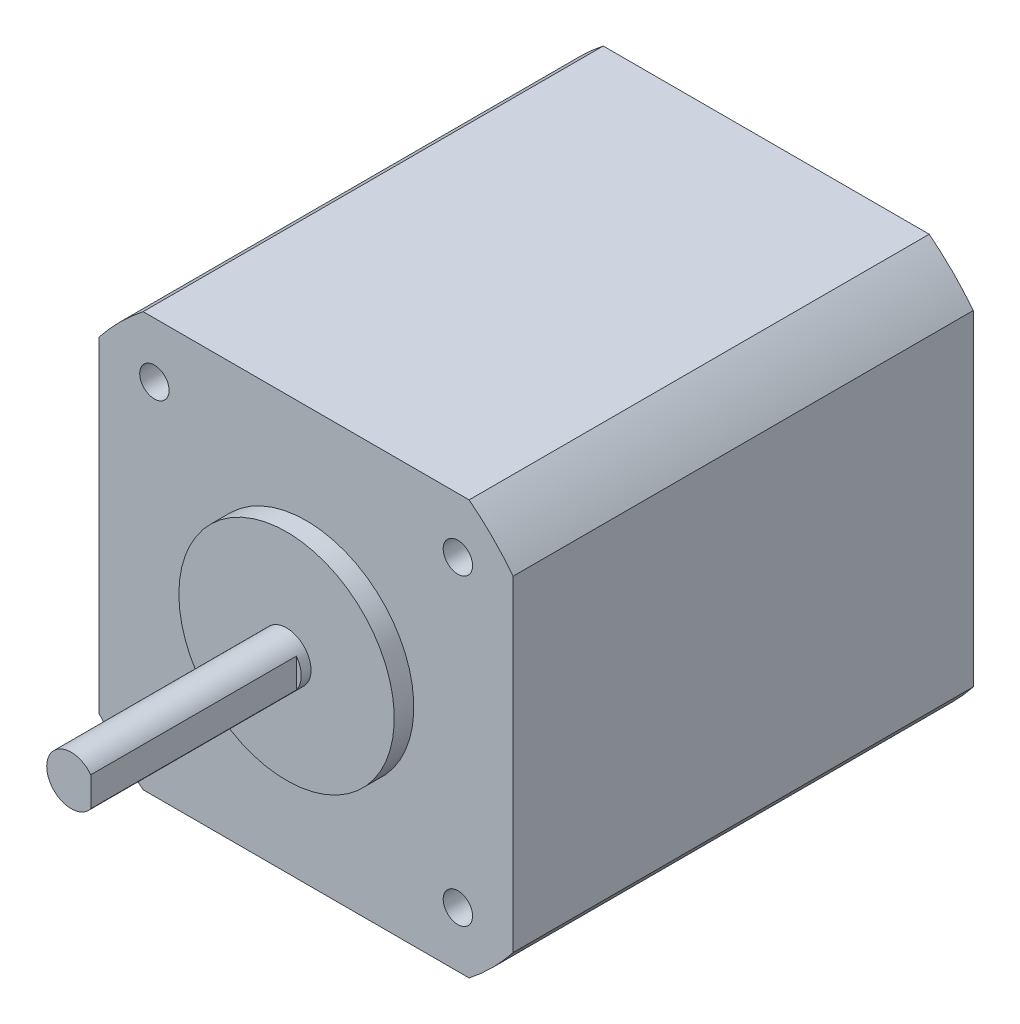
ISO-10303-21;
HEADER;
FILE_DESCRIPTION(('STEP AP214'),'2;1');
FILE_NAME('part.step','',(''),(''),'','','');
FILE_SCHEMA(('AUTOMOTIVE_DESIGN { 1 0 10303 214 1 1 1 1 }'));
ENDSEC;
DATA;
#1=APPLICATION_CONTEXT('core data for automotive mechanical design processes');
#2=APPLICATION_PROTOCOL_DEFINITION('international standard','automotive_design',2000,#1);
#3=PRODUCT_CONTEXT('',#1,'mechanical');
#4=PRODUCT('Part','Part','',(#3));
#5=PRODUCT_RELATED_PRODUCT_CATEGORY('part','',(#4));
#6=PRODUCT_DEFINITION_FORMATION('','',#4);
#7=PRODUCT_DEFINITION_CONTEXT('part definition',#1,'design');
#8=PRODUCT_DEFINITION('design','',#6,#7);
#9=PRODUCT_DEFINITION_SHAPE('','',#8);
#10=(LENGTH_UNIT() NAMED_UNIT(*) SI_UNIT(.MILLI.,.METRE.));
#11=(NAMED_UNIT(*) PLANE_ANGLE_UNIT() SI_UNIT($,.RADIAN.));
#12=(NAMED_UNIT(*) SI_UNIT($,.STERADIAN.) SOLID_ANGLE_UNIT());
#13=UNCERTAINTY_MEASURE_WITH_UNIT(LENGTH_MEASURE(1.E-05),#10,'distance_accuracy_value','');
#14=(GEOMETRIC_REPRESENTATION_CONTEXT(3) GLOBAL_UNCERTAINTY_ASSIGNED_CONTEXT((#13)) GLOBAL_UNIT_ASSIGNED_CONTEXT((#10,
#11,#12)) REPRESENTATION_CONTEXT('',''));
#15=CARTESIAN_POINT('',(0.,0.,0.));
#16=DIRECTION('',(0.,0.,1.));
#17=DIRECTION('',(1.,0.,0.));
#18=AXIS2_PLACEMENT_3D('',#15,#16,#17);
#19=CARTESIAN_POINT('',(2.,-2.,50.));
#20=DIRECTION('',(0.,0.,-1.));
#21=DIRECTION('',(-1.,0.,0.));
#22=AXIS2_PLACEMENT_3D('',#19,#20,#21);
#23=PLANE('',#22);
#24=CARTESIAN_POINT('',(0.,0.,50.));
#25=DIRECTION('',(0.,0.,-1.));
#26=DIRECTION('',(-1.,0.,0.));
#27=AXIS2_PLACEMENT_3D('',#24,#25,#26);
#28=CIRCLE('',#27,2.5);
#29=CARTESIAN_POINT('',(2.,1.5,50.));
#30=VERTEX_POINT('',#29);
#31=CARTESIAN_POINT('',(2.,-1.5,50.));
#32=VERTEX_POINT('',#31);
#33=EDGE_CURVE('E19',#30,#32,#28,.T.);
#34=ORIENTED_EDGE('',*,*,#33,.F.);
#35=DIRECTION('',(0.,1.,0.));
#36=VECTOR('',#35,1.);
#37=CARTESIAN_POINT('',(2.,2.,50.));
#38=LINE('',#37,#36);
#39=EDGE_CURVE('E95',#30,#32,#38,.F.);
#40=ORIENTED_EDGE('',*,*,#39,.T.);
#41=EDGE_LOOP('',(#34,#40));
#42=FACE_BOUND('',#41,.T.);
#43=ADVANCED_FACE('F16',(#42),#23,.F.);
#44=CARTESIAN_POINT('',(2.,2.,72.));
#45=DIRECTION('',(-1.,0.,0.));
#46=DIRECTION('',(0.,0.,1.));
#47=AXIS2_PLACEMENT_3D('',#44,#45,#46);
#48=PLANE('',#47);
#49=DIRECTION('',(0.,0.,-1.));
#50=VECTOR('',#49,1.);
#51=CARTESIAN_POINT('',(2.,1.5,49.));
#52=LINE('',#51,#50);
#53=CARTESIAN_POINT('',(2.,1.5,71.));
#54=VERTEX_POINT('',#53);
#55=EDGE_CURVE('E99',#54,#30,#52,.T.);
#56=ORIENTED_EDGE('',*,*,#55,.F.);
#57=DIRECTION('',(0.,1.,0.));
#58=VECTOR('',#57,1.);
#59=CARTESIAN_POINT('',(2.,0.,71.));
#60=LINE('',#59,#58);
#61=CARTESIAN_POINT('',(2.,-1.5,71.));
#62=VERTEX_POINT('',#61);
#63=EDGE_CURVE('E102',#54,#62,#60,.F.);
#64=ORIENTED_EDGE('',*,*,#63,.T.);
#65=DIRECTION('',(0.,0.,-1.));
#66=VECTOR('',#65,1.);
#67=CARTESIAN_POINT('',(2.,-1.5,49.));
#68=LINE('',#67,#66);
#69=EDGE_CURVE('E101',#32,#62,#68,.F.);
#70=ORIENTED_EDGE('',*,*,#69,.F.);
#71=ORIENTED_EDGE('',*,*,#39,.F.);
#72=EDGE_LOOP('',(#56,#64,#70,#71));
#73=FACE_BOUND('',#72,.T.);
#74=ADVANCED_FACE('F98',(#73),#48,.F.);
#75=CARTESIAN_POINT('',(2.5,0.,71.));
#76=DIRECTION('',(0.,0.,-1.));
#77=DIRECTION('',(-1.,0.,0.));
#78=AXIS2_PLACEMENT_3D('',#75,#76,#77);
#79=PLANE('',#78);
#80=ORIENTED_EDGE('',*,*,#63,.F.);
#81=CARTESIAN_POINT('',(0.,0.,71.));
#82=DIRECTION('',(0.,0.,-1.));
#83=DIRECTION('',(-1.,0.,0.));
#84=AXIS2_PLACEMENT_3D('',#81,#82,#83);
#85=CIRCLE('',#84,2.5);
#86=EDGE_CURVE('E107',#62,#54,#85,.T.);
#87=ORIENTED_EDGE('',*,*,#86,.F.);
#88=EDGE_LOOP('',(#80,#87));
#89=FACE_BOUND('',#88,.T.);
#90=ADVANCED_FACE('F228',(#89),#79,.F.);
#91=CARTESIAN_POINT('',(0.,0.,49.));
#92=DIRECTION('',(0.,0.,-1.));
#93=DIRECTION('',(-1.,0.,0.));
#94=AXIS2_PLACEMENT_3D('',#91,#92,#93);
#95=CYLINDRICAL_SURFACE('',#94,2.5);
#96=CARTESIAN_POINT('',(0.,0.,49.));
#97=DIRECTION('',(0.,0.,-1.));
#98=DIRECTION('',(-1.,0.,0.));
#99=AXIS2_PLACEMENT_3D('',#96,#97,#98);
#100=CIRCLE('',#99,2.5);
#101=CARTESIAN_POINT('',(-2.5,0.,49.));
#102=VERTEX_POINT('',#101);
#103=EDGE_CURVE('E174',#102,#102,#100,.F.);
#104=ORIENTED_EDGE('',*,*,#103,.T.);
#105=EDGE_LOOP('',(#104));
#106=FACE_BOUND('',#105,.T.);
#107=ORIENTED_EDGE('',*,*,#69,.T.);
#108=ORIENTED_EDGE('',*,*,#86,.T.);
#109=ORIENTED_EDGE('',*,*,#55,.T.);
#110=ORIENTED_EDGE('',*,*,#33,.T.);
#111=EDGE_LOOP('',(#107,#108,#109,#110));
#112=FACE_BOUND('',#111,.T.);
#113=ADVANCED_FACE('F105',(#106,#112),#95,.T.);
#114=CARTESIAN_POINT('',(17.,-15.5,42.5));
#115=DIRECTION('',(0.,0.,-1.));
#116=DIRECTION('',(-1.,0.,0.));
#117=AXIS2_PLACEMENT_3D('',#114,#115,#116);
#118=PLANE('',#117);
#119=CARTESIAN_POINT('',(15.5,-15.5,42.5));
#120=DIRECTION('',(0.,0.,1.));
#121=DIRECTION('',(1.,0.,0.));
#122=AXIS2_PLACEMENT_3D('',#119,#120,#121);
#123=CIRCLE('',#122,1.5);
#124=CARTESIAN_POINT('',(17.,-15.5,42.5));
#125=VERTEX_POINT('',#124);
#126=EDGE_CURVE('E171',#125,#125,#123,.T.);
#127=ORIENTED_EDGE('',*,*,#126,.T.);
#128=EDGE_LOOP('',(#127));
#129=FACE_BOUND('',#128,.T.);
#130=ADVANCED_FACE('F216',(#129),#118,.F.);
#131=CARTESIAN_POINT('',(-14.,-15.5,42.5));
#132=DIRECTION('',(0.,0.,-1.));
#133=DIRECTION('',(-1.,0.,0.));
#134=AXIS2_PLACEMENT_3D('',#131,#132,#133);
#135=PLANE('',#134);
#136=CARTESIAN_POINT('',(-15.5,-15.5,42.5));
#137=DIRECTION('',(0.,0.,1.));
#138=DIRECTION('',(1.,0.,0.));
#139=AXIS2_PLACEMENT_3D('',#136,#137,#138);
#140=CIRCLE('',#139,1.5);
#141=CARTESIAN_POINT('',(-14.,-15.5,42.5));
#142=VERTEX_POINT('',#141);
#143=EDGE_CURVE('E168',#142,#142,#140,.T.);
#144=ORIENTED_EDGE('',*,*,#143,.T.);
#145=EDGE_LOOP('',(#144));
#146=FACE_BOUND('',#145,.T.);
#147=ADVANCED_FACE('F218',(#146),#135,.F.);
#148=CARTESIAN_POINT('',(17.,15.5,42.5));
#149=DIRECTION('',(0.,0.,-1.));
#150=DIRECTION('',(-1.,0.,0.));
#151=AXIS2_PLACEMENT_3D('',#148,#149,#150);
#152=PLANE('',#151);
#153=CARTESIAN_POINT('',(15.5,15.5,42.5));
#154=DIRECTION('',(0.,0.,1.));
#155=DIRECTION('',(1.,0.,0.));
#156=AXIS2_PLACEMENT_3D('',#153,#154,#155);
#157=CIRCLE('',#156,1.5);
#158=CARTESIAN_POINT('',(17.,15.5,42.5));
#159=VERTEX_POINT('',#158);
#160=EDGE_CURVE('E165',#159,#159,#157,.T.);
#161=ORIENTED_EDGE('',*,*,#160,.T.);
#162=EDGE_LOOP('',(#161));
#163=FACE_BOUND('',#162,.T.);
#164=ADVANCED_FACE('F225',(#163),#152,.F.);
#165=CARTESIAN_POINT('',(-14.,15.5,42.5));
#166=DIRECTION('',(0.,0.,-1.));
#167=DIRECTION('',(-1.,0.,0.));
#168=AXIS2_PLACEMENT_3D('',#165,#166,#167);
#169=PLANE('',#168);
#170=CARTESIAN_POINT('',(-15.5,15.5,42.5));
#171=DIRECTION('',(0.,0.,1.));
#172=DIRECTION('',(1.,0.,0.));
#173=AXIS2_PLACEMENT_3D('',#170,#171,#172);
#174=CIRCLE('',#173,1.5);
#175=CARTESIAN_POINT('',(-14.,15.5,42.5));
#176=VERTEX_POINT('',#175);
#177=EDGE_CURVE('E162',#176,#176,#174,.T.);
#178=ORIENTED_EDGE('',*,*,#177,.T.);
#179=EDGE_LOOP('',(#178));
#180=FACE_BOUND('',#179,.T.);
#181=ADVANCED_FACE('F183',(#180),#169,.F.);
#182=CARTESIAN_POINT('',(11.,0.,49.));
#183=DIRECTION('',(0.,0.,-1.));
#184=DIRECTION('',(-1.,0.,0.));
#185=AXIS2_PLACEMENT_3D('',#182,#183,#184);
#186=PLANE('',#185);
#187=ORIENTED_EDGE('',*,*,#103,.F.);
#188=EDGE_LOOP('',(#187));
#189=FACE_BOUND('',#188,.T.);
#190=CARTESIAN_POINT('',(0.,0.,49.));
#191=DIRECTION('',(0.,0.,-1.));
#192=DIRECTION('',(-1.,0.,0.));
#193=AXIS2_PLACEMENT_3D('',#190,#191,#192);
#194=CIRCLE('',#193,11.);
#195=CARTESIAN_POINT('',(-11.,0.,49.));
#196=VERTEX_POINT('',#195);
#197=EDGE_CURVE('E159',#196,#196,#194,.T.);
#198=ORIENTED_EDGE('',*,*,#197,.F.);
#199=EDGE_LOOP('',(#198));
#200=FACE_BOUND('',#199,.T.);
#201=ADVANCED_FACE('F179',(#189,#200),#186,.F.);
#202=CARTESIAN_POINT('',(15.5,-15.5,48.));
#203=DIRECTION('',(0.,0.,1.));
#204=DIRECTION('',(1.,0.,0.));
#205=AXIS2_PLACEMENT_3D('',#202,#203,#204);
#206=CYLINDRICAL_SURFACE('',#205,1.5);
#207=CARTESIAN_POINT('',(15.5,-15.5,47.));
#208=DIRECTION('',(0.,0.,1.));
#209=DIRECTION('',(1.,0.,0.));
#210=AXIS2_PLACEMENT_3D('',#207,#208,#209);
#211=CIRCLE('',#210,1.5);
#212=CARTESIAN_POINT('',(17.,-15.5,47.));
#213=VERTEX_POINT('',#212);
#214=EDGE_CURVE('E156',#213,#213,#211,.T.);
#215=ORIENTED_EDGE('',*,*,#214,.T.);
#216=EDGE_LOOP('',(#215));
#217=FACE_BOUND('',#216,.T.);
#218=ORIENTED_EDGE('',*,*,#126,.F.);
#219=EDGE_LOOP('',(#218));
#220=FACE_BOUND('',#219,.T.);
#221=ADVANCED_FACE('F182',(#217,#220),#206,.F.);
#222=CARTESIAN_POINT('',(-15.5,-15.5,48.));
#223=DIRECTION('',(0.,0.,1.));
#224=DIRECTION('',(1.,0.,0.));
#225=AXIS2_PLACEMENT_3D('',#222,#223,#224);
#226=CYLINDRICAL_SURFACE('',#225,1.5);
#227=CARTESIAN_POINT('',(-15.5,-15.5,47.));
#228=DIRECTION('',(0.,0.,1.));
#229=DIRECTION('',(1.,0.,0.));
#230=AXIS2_PLACEMENT_3D('',#227,#228,#229);
#231=CIRCLE('',#230,1.5);
#232=CARTESIAN_POINT('',(-14.,-15.5,47.));
#233=VERTEX_POINT('',#232);
#234=EDGE_CURVE('E153',#233,#233,#231,.T.);
#235=ORIENTED_EDGE('',*,*,#234,.T.);
#236=EDGE_LOOP('',(#235));
#237=FACE_BOUND('',#236,.T.);
#238=ORIENTED_EDGE('',*,*,#143,.F.);
#239=EDGE_LOOP('',(#238));
#240=FACE_BOUND('',#239,.T.);
#241=ADVANCED_FACE('F212',(#237,#240),#226,.F.);
#242=CARTESIAN_POINT('',(15.5,15.5,48.));
#243=DIRECTION('',(0.,0.,1.));
#244=DIRECTION('',(1.,0.,0.));
#245=AXIS2_PLACEMENT_3D('',#242,#243,#244);
#246=CYLINDRICAL_SURFACE('',#245,1.5);
#247=CARTESIAN_POINT('',(15.5,15.5,47.));
#248=DIRECTION('',(0.,0.,1.));
#249=DIRECTION('',(1.,0.,0.));
#250=AXIS2_PLACEMENT_3D('',#247,#248,#249);
#251=CIRCLE('',#250,1.5);
#252=CARTESIAN_POINT('',(17.,15.5,47.));
#253=VERTEX_POINT('',#252);
#254=EDGE_CURVE('E150',#253,#253,#251,.T.);
#255=ORIENTED_EDGE('',*,*,#254,.T.);
#256=EDGE_LOOP('',(#255));
#257=FACE_BOUND('',#256,.T.);
#258=ORIENTED_EDGE('',*,*,#160,.F.);
#259=EDGE_LOOP('',(#258));
#260=FACE_BOUND('',#259,.T.);
#261=ADVANCED_FACE('F269',(#257,#260),#246,.F.);
#262=CARTESIAN_POINT('',(-15.5,15.5,48.));
#263=DIRECTION('',(0.,0.,1.));
#264=DIRECTION('',(1.,0.,0.));
#265=AXIS2_PLACEMENT_3D('',#262,#263,#264);
#266=CYLINDRICAL_SURFACE('',#265,1.5);
#267=CARTESIAN_POINT('',(-15.5,15.5,47.));
#268=DIRECTION('',(0.,0.,1.));
#269=DIRECTION('',(1.,0.,0.));
#270=AXIS2_PLACEMENT_3D('',#267,#268,#269);
#271=CIRCLE('',#270,1.5);
#272=CARTESIAN_POINT('',(-14.,15.5,47.));
#273=VERTEX_POINT('',#272);
#274=EDGE_CURVE('E147',#273,#273,#271,.T.);
#275=ORIENTED_EDGE('',*,*,#274,.T.);
#276=EDGE_LOOP('',(#275));
#277=FACE_BOUND('',#276,.T.);
#278=ORIENTED_EDGE('',*,*,#177,.F.);
#279=EDGE_LOOP('',(#278));
#280=FACE_BOUND('',#279,.T.);
#281=ADVANCED_FACE('F191',(#277,#280),#266,.F.);
#282=CARTESIAN_POINT('',(0.,0.,47.));
#283=DIRECTION('',(0.,0.,-1.));
#284=DIRECTION('',(-1.,0.,0.));
#285=AXIS2_PLACEMENT_3D('',#282,#283,#284);
#286=CYLINDRICAL_SURFACE('',#285,11.);
#287=ORIENTED_EDGE('',*,*,#197,.T.);
#288=EDGE_LOOP('',(#287));
#289=FACE_BOUND('',#288,.T.);
#290=CARTESIAN_POINT('',(0.,0.,47.));
#291=DIRECTION('',(0.,0.,-1.));
#292=DIRECTION('',(-1.,0.,0.));
#293=AXIS2_PLACEMENT_3D('',#290,#291,#292);
#294=CIRCLE('',#293,11.);
#295=CARTESIAN_POINT('',(-11.,0.,47.));
#296=VERTEX_POINT('',#295);
#297=EDGE_CURVE('E144',#296,#296,#294,.F.);
#298=ORIENTED_EDGE('',*,*,#297,.T.);
#299=EDGE_LOOP('',(#298));
#300=FACE_BOUND('',#299,.T.);
#301=ADVANCED_FACE('F187',(#289,#300),#286,.T.);
#302=CARTESIAN_POINT('',(-16.65,-21.15,47.));
#303=DIRECTION('',(0.,0.,-1.));
#304=DIRECTION('',(-1.,0.,0.));
#305=AXIS2_PLACEMENT_3D('',#302,#303,#304);
#306=PLANE('',#305);
#307=ORIENTED_EDGE('',*,*,#297,.F.);
#308=EDGE_LOOP('',(#307));
#309=FACE_BOUND('',#308,.T.);
#310=DIRECTION('',(0.,1.,0.));
#311=VECTOR('',#310,1.);
#312=CARTESIAN_POINT('',(21.15,-16.65,47.));
#313=LINE('',#312,#311);
#314=CARTESIAN_POINT('',(21.1500000000001,-16.6500000000003,47.));
#315=VERTEX_POINT('',#314);
#316=CARTESIAN_POINT('',(21.15,16.6500000000002,47.));
#317=VERTEX_POINT('',#316);
#318=EDGE_CURVE('E133',#315,#317,#313,.T.);
#319=ORIENTED_EDGE('',*,*,#318,.T.);
#320=CARTESIAN_POINT('',(0.,0.,47.));
#321=DIRECTION('',(0.,0.,-1.));
#322=DIRECTION('',(-1.,0.,0.));
#323=AXIS2_PLACEMENT_3D('',#320,#321,#322);
#324=CIRCLE('',#323,26.917373571729);
#325=CARTESIAN_POINT('',(16.6500000000003,21.1500000000001,47.));
#326=VERTEX_POINT('',#325);
#327=EDGE_CURVE('E130',#326,#317,#324,.T.);
#328=ORIENTED_EDGE('',*,*,#327,.F.);
#329=DIRECTION('',(1.,0.,0.));
#330=VECTOR('',#329,1.);
#331=CARTESIAN_POINT('',(16.65,21.15,47.));
#332=LINE('',#331,#330);
#333=CARTESIAN_POINT('',(-16.6500000000002,21.15,47.));
#334=VERTEX_POINT('',#333);
#335=EDGE_CURVE('E138',#326,#334,#332,.F.);
#336=ORIENTED_EDGE('',*,*,#335,.T.);
#337=CARTESIAN_POINT('',(0.,0.,47.));
#338=DIRECTION('',(0.,0.,-1.));
#339=DIRECTION('',(-1.,0.,0.));
#340=AXIS2_PLACEMENT_3D('',#337,#338,#339);
#341=CIRCLE('',#340,26.917373571729);
#342=CARTESIAN_POINT('',(-21.1500000000001,16.6500000000003,47.));
#343=VERTEX_POINT('',#342);
#344=EDGE_CURVE('E135',#343,#334,#341,.T.);
#345=ORIENTED_EDGE('',*,*,#344,.F.);
#346=DIRECTION('',(0.,1.,0.));
#347=VECTOR('',#346,1.);
#348=CARTESIAN_POINT('',(-21.15,16.65,47.));
#349=LINE('',#348,#347);
#350=CARTESIAN_POINT('',(-21.15,-16.6500000000002,47.));
#351=VERTEX_POINT('',#350);
#352=EDGE_CURVE('E143',#343,#351,#349,.F.);
#353=ORIENTED_EDGE('',*,*,#352,.T.);
#354=CARTESIAN_POINT('',(0.,0.,47.));
#355=DIRECTION('',(0.,0.,-1.));
#356=DIRECTION('',(-1.,0.,0.));
#357=AXIS2_PLACEMENT_3D('',#354,#355,#356);
#358=CIRCLE('',#357,26.917373571729);
#359=CARTESIAN_POINT('',(-16.6500000000002,-21.15,47.));
#360=VERTEX_POINT('',#359);
#361=EDGE_CURVE('E140',#360,#351,#358,.T.);
#362=ORIENTED_EDGE('',*,*,#361,.F.);
#363=DIRECTION('',(1.,0.,0.));
#364=VECTOR('',#363,1.);
#365=CARTESIAN_POINT('',(-16.65,-21.15,47.));
#366=LINE('',#365,#364);
#367=CARTESIAN_POINT('',(16.6500000000002,-21.15,47.));
#368=VERTEX_POINT('',#367);
#369=EDGE_CURVE('E404',#360,#368,#366,.T.);
#370=ORIENTED_EDGE('',*,*,#369,.T.);
#371=CARTESIAN_POINT('',(0.,0.,47.));
#372=DIRECTION('',(0.,0.,-1.));
#373=DIRECTION('',(-1.,0.,0.));
#374=AXIS2_PLACEMENT_3D('',#371,#372,#373);
#375=CIRCLE('',#374,26.917373571729);
#376=EDGE_CURVE('E126',#315,#368,#375,.T.);
#377=ORIENTED_EDGE('',*,*,#376,.F.);
#378=EDGE_LOOP('',(#319,#328,#336,#345,#353,#362,#370,#377));
#379=FACE_BOUND('',#378,.T.);
#380=ORIENTED_EDGE('',*,*,#274,.F.);
#381=EDGE_LOOP('',(#380));
#382=FACE_BOUND('',#381,.T.);
#383=ORIENTED_EDGE('',*,*,#254,.F.);
#384=EDGE_LOOP('',(#383));
#385=FACE_BOUND('',#384,.T.);
#386=ORIENTED_EDGE('',*,*,#234,.F.);
#387=EDGE_LOOP('',(#386));
#388=FACE_BOUND('',#387,.T.);
#389=ORIENTED_EDGE('',*,*,#214,.F.);
#390=EDGE_LOOP('',(#389));
#391=FACE_BOUND('',#390,.T.);
#392=ADVANCED_FACE('F190',(#309,#379,#382,#385,#388,#391),#306,.F.);
#393=CARTESIAN_POINT('',(0.,0.,0.));
#394=DIRECTION('',(0.,0.,-1.));
#395=DIRECTION('',(-1.,0.,0.));
#396=AXIS2_PLACEMENT_3D('',#393,#394,#395);
#397=CYLINDRICAL_SURFACE('',#396,26.917373571729);
#398=ORIENTED_EDGE('',*,*,#361,.T.);
#399=DIRECTION('',(0.,0.,-1.));
#400=VECTOR('',#399,1.);
#401=CARTESIAN_POINT('',(-21.15,-16.65,0.));
#402=LINE('',#401,#400);
#403=CARTESIAN_POINT('',(-21.15,-16.6500000000002,0.));
#404=VERTEX_POINT('',#403);
#405=EDGE_CURVE('E392',#351,#404,#402,.T.);
#406=ORIENTED_EDGE('',*,*,#405,.T.);
#407=CARTESIAN_POINT('',(0.,0.,0.));
#408=DIRECTION('',(0.,0.,-1.));
#409=DIRECTION('',(-1.,0.,0.));
#410=AXIS2_PLACEMENT_3D('',#407,#408,#409);
#411=CIRCLE('',#410,26.917373571729);
#412=CARTESIAN_POINT('',(-16.6500000000002,-21.15,0.));
#413=VERTEX_POINT('',#412);
#414=EDGE_CURVE('E123',#413,#404,#411,.T.);
#415=ORIENTED_EDGE('',*,*,#414,.F.);
#416=DIRECTION('',(0.,0.,1.));
#417=VECTOR('',#416,1.);
#418=CARTESIAN_POINT('',(-16.65,-21.15,0.));
#419=LINE('',#418,#417);
#420=EDGE_CURVE('E128',#413,#360,#419,.T.);
#421=ORIENTED_EDGE('',*,*,#420,.T.);
#422=EDGE_LOOP('',(#398,#406,#415,#421));
#423=FACE_BOUND('',#422,.T.);
#424=ADVANCED_FACE('F197',(#423),#397,.T.);
#425=CARTESIAN_POINT('',(-21.15,16.65,0.));
#426=DIRECTION('',(1.,0.,0.));
#427=DIRECTION('',(0.,0.,-1.));
#428=AXIS2_PLACEMENT_3D('',#425,#426,#427);
#429=PLANE('',#428);
#430=ORIENTED_EDGE('',*,*,#405,.F.);
#431=ORIENTED_EDGE('',*,*,#352,.F.);
#432=DIRECTION('',(0.,0.,-1.));
#433=VECTOR('',#432,1.);
#434=CARTESIAN_POINT('',(-21.1500000000002,16.6500000000002,0.));
#435=LINE('',#434,#433);
#436=CARTESIAN_POINT('',(-21.1500000000001,16.6500000000003,0.));
#437=VERTEX_POINT('',#436);
#438=EDGE_CURVE('E139',#437,#343,#435,.F.);
#439=ORIENTED_EDGE('',*,*,#438,.F.);
#440=DIRECTION('',(0.,1.,0.));
#441=VECTOR('',#440,1.);
#442=CARTESIAN_POINT('',(-21.15,-21.15,0.));
#443=LINE('',#442,#441);
#444=EDGE_CURVE('E122',#404,#437,#443,.T.);
#445=ORIENTED_EDGE('',*,*,#444,.F.);
#446=EDGE_LOOP('',(#430,#431,#439,#445));
#447=FACE_BOUND('',#446,.T.);
#448=ADVANCED_FACE('F259',(#447),#429,.F.);
#449=CARTESIAN_POINT('',(0.,0.,0.));
#450=DIRECTION('',(0.,0.,-1.));
#451=DIRECTION('',(-1.,0.,0.));
#452=AXIS2_PLACEMENT_3D('',#449,#450,#451);
#453=CYLINDRICAL_SURFACE('',#452,26.917373571729);
#454=ORIENTED_EDGE('',*,*,#344,.T.);
#455=DIRECTION('',(0.,0.,-1.));
#456=VECTOR('',#455,1.);
#457=CARTESIAN_POINT('',(-16.65,21.15,0.));
#458=LINE('',#457,#456);
#459=CARTESIAN_POINT('',(-16.6500000000002,21.15,0.));
#460=VERTEX_POINT('',#459);
#461=EDGE_CURVE('E408',#334,#460,#458,.T.);
#462=ORIENTED_EDGE('',*,*,#461,.T.);
#463=CARTESIAN_POINT('',(0.,0.,0.));
#464=DIRECTION('',(0.,0.,-1.));
#465=DIRECTION('',(-1.,0.,0.));
#466=AXIS2_PLACEMENT_3D('',#463,#464,#465);
#467=CIRCLE('',#466,26.917373571729);
#468=EDGE_CURVE('E119',#437,#460,#467,.T.);
#469=ORIENTED_EDGE('',*,*,#468,.F.);
#470=ORIENTED_EDGE('',*,*,#438,.T.);
#471=EDGE_LOOP('',(#454,#462,#469,#470));
#472=FACE_BOUND('',#471,.T.);
#473=ADVANCED_FACE('F255',(#472),#453,.T.);
#474=CARTESIAN_POINT('',(16.65,21.15,0.));
#475=DIRECTION('',(0.,-1.,0.));
#476=DIRECTION('',(0.,0.,-1.));
#477=AXIS2_PLACEMENT_3D('',#474,#475,#476);
#478=PLANE('',#477);
#479=ORIENTED_EDGE('',*,*,#461,.F.);
#480=ORIENTED_EDGE('',*,*,#335,.F.);
#481=DIRECTION('',(0.,0.,-1.));
#482=VECTOR('',#481,1.);
#483=CARTESIAN_POINT('',(16.6500000000002,21.1500000000002,0.));
#484=LINE('',#483,#482);
#485=CARTESIAN_POINT('',(16.6500000000003,21.1500000000001,0.));
#486=VERTEX_POINT('',#485);
#487=EDGE_CURVE('E134',#486,#326,#484,.F.);
#488=ORIENTED_EDGE('',*,*,#487,.F.);
#489=DIRECTION('',(-1.,0.,0.));
#490=VECTOR('',#489,1.);
#491=CARTESIAN_POINT('',(-16.65,21.15,0.));
#492=LINE('',#491,#490);
#493=EDGE_CURVE('E118',#460,#486,#492,.F.);
#494=ORIENTED_EDGE('',*,*,#493,.F.);
#495=EDGE_LOOP('',(#479,#480,#488,#494));
#496=FACE_BOUND('',#495,.T.);
#497=ADVANCED_FACE('F251',(#496),#478,.F.);
#498=CARTESIAN_POINT('',(0.,0.,0.));
#499=DIRECTION('',(0.,0.,-1.));
#500=DIRECTION('',(-1.,0.,0.));
#501=AXIS2_PLACEMENT_3D('',#498,#499,#500);
#502=CYLINDRICAL_SURFACE('',#501,26.917373571729);
#503=ORIENTED_EDGE('',*,*,#327,.T.);
#504=DIRECTION('',(0.,0.,1.));
#505=VECTOR('',#504,1.);
#506=CARTESIAN_POINT('',(21.15,16.65,0.));
#507=LINE('',#506,#505);
#508=CARTESIAN_POINT('',(21.15,16.6500000000002,0.));
#509=VERTEX_POINT('',#508);
#510=EDGE_CURVE('E407',#317,#509,#507,.F.);
#511=ORIENTED_EDGE('',*,*,#510,.T.);
#512=CARTESIAN_POINT('',(0.,0.,0.));
#513=DIRECTION('',(0.,0.,-1.));
#514=DIRECTION('',(-1.,0.,0.));
#515=AXIS2_PLACEMENT_3D('',#512,#513,#514);
#516=CIRCLE('',#515,26.917373571729);
#517=EDGE_CURVE('E115',#486,#509,#516,.T.);
#518=ORIENTED_EDGE('',*,*,#517,.F.);
#519=ORIENTED_EDGE('',*,*,#487,.T.);
#520=EDGE_LOOP('',(#503,#511,#518,#519));
#521=FACE_BOUND('',#520,.T.);
#522=ADVANCED_FACE('F247',(#521),#502,.T.);
#523=CARTESIAN_POINT('',(21.15,-16.65,0.));
#524=DIRECTION('',(-1.,0.,0.));
#525=DIRECTION('',(0.,0.,1.));
#526=AXIS2_PLACEMENT_3D('',#523,#524,#525);
#527=PLANE('',#526);
#528=ORIENTED_EDGE('',*,*,#510,.F.);
#529=ORIENTED_EDGE('',*,*,#318,.F.);
#530=DIRECTION('',(0.,0.,-1.));
#531=VECTOR('',#530,1.);
#532=CARTESIAN_POINT('',(21.1500000000002,-16.6500000000002,0.));
#533=LINE('',#532,#531);
#534=CARTESIAN_POINT('',(21.1500000000001,-16.6500000000003,0.));
#535=VERTEX_POINT('',#534);
#536=EDGE_CURVE('E129',#535,#315,#533,.F.);
#537=ORIENTED_EDGE('',*,*,#536,.F.);
#538=DIRECTION('',(0.,1.,0.));
#539=VECTOR('',#538,1.);
#540=CARTESIAN_POINT('',(21.15,-21.15,0.));
#541=LINE('',#540,#539);
#542=EDGE_CURVE('E114',#509,#535,#541,.F.);
#543=ORIENTED_EDGE('',*,*,#542,.F.);
#544=EDGE_LOOP('',(#528,#529,#537,#543));
#545=FACE_BOUND('',#544,.T.);
#546=ADVANCED_FACE('F244',(#545),#527,.F.);
#547=CARTESIAN_POINT('',(0.,0.,0.));
#548=DIRECTION('',(0.,0.,-1.));
#549=DIRECTION('',(-1.,0.,0.));
#550=AXIS2_PLACEMENT_3D('',#547,#548,#549);
#551=CYLINDRICAL_SURFACE('',#550,26.917373571729);
#552=ORIENTED_EDGE('',*,*,#376,.T.);
#553=DIRECTION('',(0.,0.,1.));
#554=VECTOR('',#553,1.);
#555=CARTESIAN_POINT('',(16.65,-21.15,0.));
#556=LINE('',#555,#554);
#557=CARTESIAN_POINT('',(16.6500000000002,-21.15,0.));
#558=VERTEX_POINT('',#557);
#559=EDGE_CURVE('E34',#368,#558,#556,.F.);
#560=ORIENTED_EDGE('',*,*,#559,.T.);
#561=CARTESIAN_POINT('',(0.,0.,0.));
#562=DIRECTION('',(0.,0.,-1.));
#563=DIRECTION('',(-1.,0.,0.));
#564=AXIS2_PLACEMENT_3D('',#561,#562,#563);
#565=CIRCLE('',#564,26.917373571729);
#566=EDGE_CURVE('E25',#535,#558,#565,.T.);
#567=ORIENTED_EDGE('',*,*,#566,.F.);
#568=ORIENTED_EDGE('',*,*,#536,.T.);
#569=EDGE_LOOP('',(#552,#560,#567,#568));
#570=FACE_BOUND('',#569,.T.);
#571=ADVANCED_FACE('F238',(#570),#551,.T.);
#572=CARTESIAN_POINT('',(-16.65,-21.15,0.));
#573=DIRECTION('',(0.,1.,0.));
#574=DIRECTION('',(0.,0.,1.));
#575=AXIS2_PLACEMENT_3D('',#572,#573,#574);
#576=PLANE('',#575);
#577=ORIENTED_EDGE('',*,*,#559,.F.);
#578=ORIENTED_EDGE('',*,*,#369,.F.);
#579=ORIENTED_EDGE('',*,*,#420,.F.);
#580=DIRECTION('',(-1.,0.,0.));
#581=VECTOR('',#580,1.);
#582=CARTESIAN_POINT('',(-16.65,-21.15,0.));
#583=LINE('',#582,#581);
#584=EDGE_CURVE('E10',#558,#413,#583,.T.);
#585=ORIENTED_EDGE('',*,*,#584,.F.);
#586=EDGE_LOOP('',(#577,#578,#579,#585));
#587=FACE_BOUND('',#586,.T.);
#588=ADVANCED_FACE('F232',(#587),#576,.F.);
#589=CARTESIAN_POINT('',(-16.65,-21.15,0.));
#590=DIRECTION('',(0.,0.,-1.));
#591=DIRECTION('',(-1.,0.,0.));
#592=AXIS2_PLACEMENT_3D('',#589,#590,#591);
#593=PLANE('',#592);
#594=ORIENTED_EDGE('',*,*,#566,.T.);
#595=ORIENTED_EDGE('',*,*,#584,.T.);
#596=ORIENTED_EDGE('',*,*,#414,.T.);
#597=ORIENTED_EDGE('',*,*,#444,.T.);
#598=ORIENTED_EDGE('',*,*,#468,.T.);
#599=ORIENTED_EDGE('',*,*,#493,.T.);
#600=ORIENTED_EDGE('',*,*,#517,.T.);
#601=ORIENTED_EDGE('',*,*,#542,.T.);
#602=EDGE_LOOP('',(#594,#595,#596,#597,#598,#599,#600,#601));
#603=FACE_BOUND('',#602,.T.);
#604=ADVANCED_FACE('F230',(#603),#593,.T.);
#605=CLOSED_SHELL('',(#43,#74,#90,#113,#130,#147,#164,#181,#201,#221,#241,#261,#281,#301,#392,
#424,#448,#473,#497,#522,#546,#571,#588,#604));
#606=MANIFOLD_SOLID_BREP('B1',#605);
#607=ADVANCED_BREP_SHAPE_REPRESENTATION('',(#18,#606),#14);
#608=SHAPE_DEFINITION_REPRESENTATION(#9,#607);
ENDSEC;
END-ISO-10303-21;
